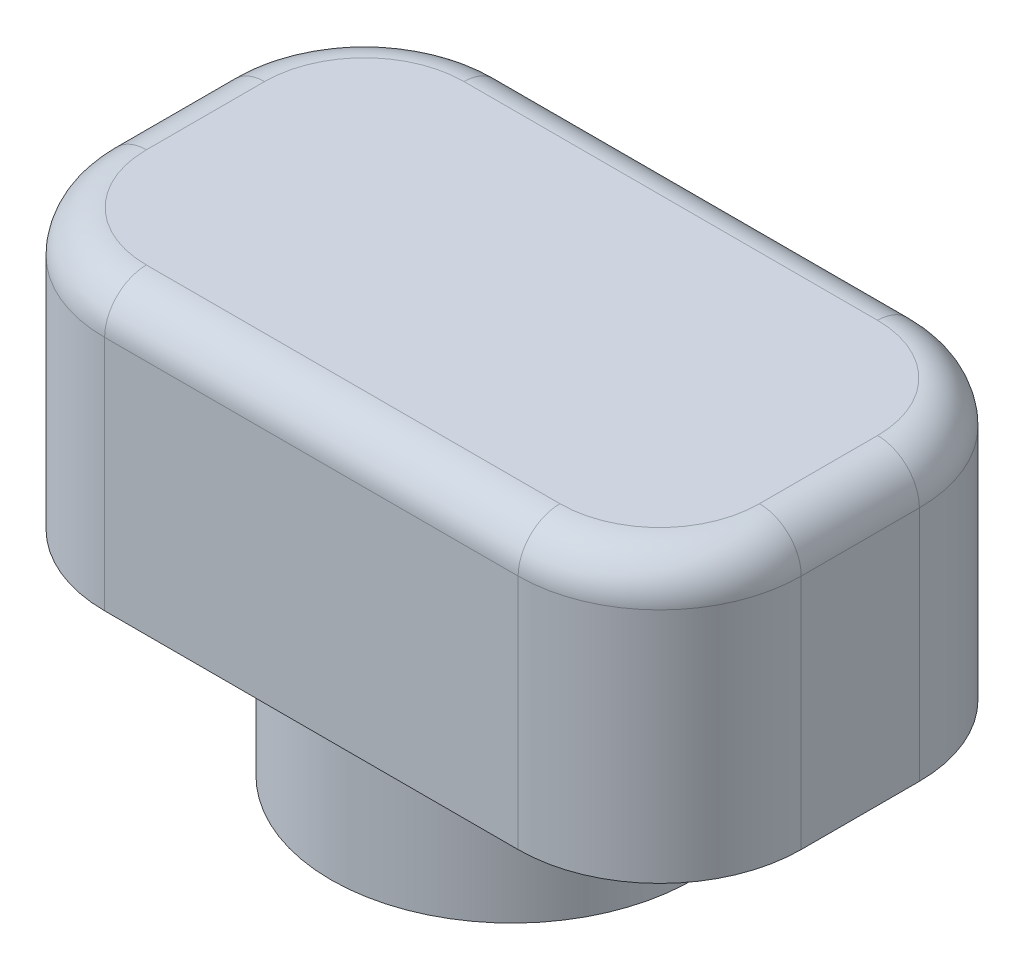
ISO-10303-21;
HEADER;
FILE_DESCRIPTION(('STEP AP214'),'2;1');
FILE_NAME('part.step','',(''),(''),'','','');
FILE_SCHEMA(('AUTOMOTIVE_DESIGN { 1 0 10303 214 1 1 1 1 }'));
ENDSEC;
DATA;
#1=APPLICATION_CONTEXT('core data for automotive mechanical design processes');
#2=APPLICATION_PROTOCOL_DEFINITION('international standard','automotive_design',2000,#1);
#3=PRODUCT_CONTEXT('',#1,'mechanical');
#4=PRODUCT('Part','Part','',(#3));
#5=PRODUCT_RELATED_PRODUCT_CATEGORY('part','',(#4));
#6=PRODUCT_DEFINITION_FORMATION('','',#4);
#7=PRODUCT_DEFINITION_CONTEXT('part definition',#1,'design');
#8=PRODUCT_DEFINITION('design','',#6,#7);
#9=PRODUCT_DEFINITION_SHAPE('','',#8);
#10=(LENGTH_UNIT() NAMED_UNIT(*) SI_UNIT(.MILLI.,.METRE.));
#11=(NAMED_UNIT(*) PLANE_ANGLE_UNIT() SI_UNIT($,.RADIAN.));
#12=(NAMED_UNIT(*) SI_UNIT($,.STERADIAN.) SOLID_ANGLE_UNIT());
#13=UNCERTAINTY_MEASURE_WITH_UNIT(LENGTH_MEASURE(1.E-05),#10,'distance_accuracy_value','');
#14=(GEOMETRIC_REPRESENTATION_CONTEXT(3) GLOBAL_UNCERTAINTY_ASSIGNED_CONTEXT((#13)) GLOBAL_UNIT_ASSIGNED_CONTEXT((#10,
#11,#12)) REPRESENTATION_CONTEXT('',''));
#15=CARTESIAN_POINT('',(0.,0.,0.));
#16=DIRECTION('',(0.,0.,1.));
#17=DIRECTION('',(1.,0.,0.));
#18=AXIS2_PLACEMENT_3D('',#15,#16,#17);
#19=CARTESIAN_POINT('',(0.,2.5,0.));
#20=DIRECTION('',(0.,-1.,0.));
#21=DIRECTION('',(0.,0.,-1.));
#22=AXIS2_PLACEMENT_3D('',#19,#20,#21);
#23=CYLINDRICAL_SURFACE('',#22,3.25);
#24=CARTESIAN_POINT('',(0.,2.5,0.));
#25=DIRECTION('',(0.,1.,0.));
#26=DIRECTION('',(0.,0.,1.));
#27=AXIS2_PLACEMENT_3D('',#24,#25,#26);
#28=CIRCLE('',#27,3.25);
#29=CARTESIAN_POINT('',(0.,2.5,3.25));
#30=VERTEX_POINT('',#29);
#31=EDGE_CURVE('E187',#30,#30,#28,.T.);
#32=ORIENTED_EDGE('',*,*,#31,.F.);
#33=EDGE_LOOP('',(#32));
#34=FACE_BOUND('',#33,.T.);
#35=CARTESIAN_POINT('',(0.,0.,0.));
#36=DIRECTION('',(0.,1.,0.));
#37=DIRECTION('',(0.,0.,1.));
#38=AXIS2_PLACEMENT_3D('',#35,#36,#37);
#39=CIRCLE('',#38,3.25);
#40=CARTESIAN_POINT('',(0.,0.,3.25));
#41=VERTEX_POINT('',#40);
#42=EDGE_CURVE('E183',#41,#41,#39,.T.);
#43=ORIENTED_EDGE('',*,*,#42,.T.);
#44=EDGE_LOOP('',(#43));
#45=FACE_BOUND('',#44,.T.);
#46=ADVANCED_FACE('F47',(#34,#45),#23,.T.);
#47=CARTESIAN_POINT('',(0.,0.,0.));
#48=DIRECTION('',(0.,1.,0.));
#49=DIRECTION('',(0.,0.,1.));
#50=AXIS2_PLACEMENT_3D('',#47,#48,#49);
#51=PLANE('',#50);
#52=CARTESIAN_POINT('',(0.,0.,0.));
#53=DIRECTION('',(0.,-1.,0.));
#54=DIRECTION('',(0.,0.,-1.));
#55=AXIS2_PLACEMENT_3D('',#52,#53,#54);
#56=CIRCLE('',#55,1.75);
#57=CARTESIAN_POINT('',(0.,0.,-1.75));
#58=VERTEX_POINT('',#57);
#59=EDGE_CURVE('E173',#58,#58,#56,.T.);
#60=ORIENTED_EDGE('',*,*,#59,.F.);
#61=EDGE_LOOP('',(#60));
#62=FACE_BOUND('',#61,.T.);
#63=ORIENTED_EDGE('',*,*,#42,.F.);
#64=EDGE_LOOP('',(#63));
#65=FACE_BOUND('',#64,.T.);
#66=ADVANCED_FACE('F354',(#62,#65),#51,.F.);
#67=CARTESIAN_POINT('',(0.,2.5,0.));
#68=DIRECTION('',(0.,-1.,0.));
#69=DIRECTION('',(0.,0.,-1.));
#70=AXIS2_PLACEMENT_3D('',#67,#68,#69);
#71=CYLINDRICAL_SURFACE('',#70,1.75);
#72=CARTESIAN_POINT('',(0.,2.5,0.));
#73=DIRECTION('',(0.,-1.,0.));
#74=DIRECTION('',(0.,0.,-1.));
#75=AXIS2_PLACEMENT_3D('',#72,#73,#74);
#76=CIRCLE('',#75,1.75);
#77=CARTESIAN_POINT('',(0.,2.5,-1.75));
#78=VERTEX_POINT('',#77);
#79=EDGE_CURVE('E179',#78,#78,#76,.T.);
#80=ORIENTED_EDGE('',*,*,#79,.F.);
#81=EDGE_LOOP('',(#80));
#82=FACE_BOUND('',#81,.T.);
#83=ORIENTED_EDGE('',*,*,#59,.T.);
#84=EDGE_LOOP('',(#83));
#85=FACE_BOUND('',#84,.T.);
#86=ADVANCED_FACE('F360',(#82,#85),#71,.F.);
#87=CARTESIAN_POINT('',(0.,2.5,0.));
#88=DIRECTION('',(0.,1.,0.));
#89=DIRECTION('',(0.,0.,1.));
#90=AXIS2_PLACEMENT_3D('',#87,#88,#89);
#91=PLANE('',#90);
#92=ORIENTED_EDGE('',*,*,#31,.T.);
#93=EDGE_LOOP('',(#92));
#94=FACE_BOUND('',#93,.T.);
#95=DIRECTION('',(0.,0.,1.));
#96=VECTOR('',#95,1.);
#97=CARTESIAN_POINT('',(-6.25,2.5,-3.6));
#98=LINE('',#97,#96);
#99=CARTESIAN_POINT('',(-6.25,2.5,-1.06));
#100=VERTEX_POINT('',#99);
#101=CARTESIAN_POINT('',(-6.25,2.5,1.06));
#102=VERTEX_POINT('',#101);
#103=EDGE_CURVE('E142',#100,#102,#98,.T.);
#104=ORIENTED_EDGE('',*,*,#103,.F.);
#105=CARTESIAN_POINT('',(-3.71,2.5,-1.06));
#106=DIRECTION('',(0.,1.,0.));
#107=DIRECTION('',(0.,0.,1.));
#108=AXIS2_PLACEMENT_3D('',#105,#106,#107);
#109=CIRCLE('',#108,2.54);
#110=CARTESIAN_POINT('',(-3.71,2.5,-3.6));
#111=VERTEX_POINT('',#110);
#112=EDGE_CURVE('E152',#100,#111,#109,.F.);
#113=ORIENTED_EDGE('',*,*,#112,.T.);
#114=DIRECTION('',(-1.,0.,0.));
#115=VECTOR('',#114,1.);
#116=CARTESIAN_POINT('',(-6.25,2.5,-3.6));
#117=LINE('',#116,#115);
#118=CARTESIAN_POINT('',(3.71,2.5,-3.6));
#119=VERTEX_POINT('',#118);
#120=EDGE_CURVE('E168',#119,#111,#117,.T.);
#121=ORIENTED_EDGE('',*,*,#120,.F.);
#122=CARTESIAN_POINT('',(3.71,2.5,-1.06));
#123=DIRECTION('',(0.,1.,0.));
#124=DIRECTION('',(0.,0.,1.));
#125=AXIS2_PLACEMENT_3D('',#122,#123,#124);
#126=CIRCLE('',#125,2.54);
#127=CARTESIAN_POINT('',(6.25,2.5,-1.06));
#128=VERTEX_POINT('',#127);
#129=EDGE_CURVE('E161',#119,#128,#126,.F.);
#130=ORIENTED_EDGE('',*,*,#129,.T.);
#131=DIRECTION('',(0.,0.,-1.));
#132=VECTOR('',#131,1.);
#133=CARTESIAN_POINT('',(6.25,2.5,-3.6));
#134=LINE('',#133,#132);
#135=CARTESIAN_POINT('',(6.25,2.5,1.06));
#136=VERTEX_POINT('',#135);
#137=EDGE_CURVE('E175',#136,#128,#134,.T.);
#138=ORIENTED_EDGE('',*,*,#137,.F.);
#139=CARTESIAN_POINT('',(3.71,2.5,1.06));
#140=DIRECTION('',(0.,1.,0.));
#141=DIRECTION('',(0.,0.,1.));
#142=AXIS2_PLACEMENT_3D('',#139,#140,#141);
#143=CIRCLE('',#142,2.54);
#144=CARTESIAN_POINT('',(3.71,2.5,3.6));
#145=VERTEX_POINT('',#144);
#146=EDGE_CURVE('E198',#136,#145,#143,.F.);
#147=ORIENTED_EDGE('',*,*,#146,.T.);
#148=DIRECTION('',(1.,0.,0.));
#149=VECTOR('',#148,1.);
#150=CARTESIAN_POINT('',(-6.25,2.5,3.6));
#151=LINE('',#150,#149);
#152=CARTESIAN_POINT('',(-3.71,2.5,3.6));
#153=VERTEX_POINT('',#152);
#154=EDGE_CURVE('E167',#153,#145,#151,.T.);
#155=ORIENTED_EDGE('',*,*,#154,.F.);
#156=CARTESIAN_POINT('',(-3.71,2.5,1.06));
#157=DIRECTION('',(0.,1.,0.));
#158=DIRECTION('',(0.,0.,1.));
#159=AXIS2_PLACEMENT_3D('',#156,#157,#158);
#160=CIRCLE('',#159,2.54);
#161=EDGE_CURVE('E148',#153,#102,#160,.F.);
#162=ORIENTED_EDGE('',*,*,#161,.T.);
#163=EDGE_LOOP('',(#104,#113,#121,#130,#138,#147,#155,#162));
#164=FACE_BOUND('',#163,.T.);
#165=ADVANCED_FACE('F163',(#94,#164),#91,.F.);
#166=CARTESIAN_POINT('',(0.,7.5,0.));
#167=DIRECTION('',(0.,1.,0.));
#168=DIRECTION('',(0.,0.,1.));
#169=AXIS2_PLACEMENT_3D('',#166,#167,#168);
#170=PLANE('',#169);
#171=CARTESIAN_POINT('',(3.71,7.5,1.06));
#172=DIRECTION('',(0.,1.,0.));
#173=DIRECTION('',(0.,0.,1.));
#174=AXIS2_PLACEMENT_3D('',#171,#172,#173);
#175=CIRCLE('',#174,1.79);
#176=CARTESIAN_POINT('',(3.71,7.5,2.85));
#177=VERTEX_POINT('',#176);
#178=CARTESIAN_POINT('',(5.5,7.5,1.06));
#179=VERTEX_POINT('',#178);
#180=EDGE_CURVE('E238',#177,#179,#175,.T.);
#181=ORIENTED_EDGE('',*,*,#180,.T.);
#182=DIRECTION('',(0.,0.,-1.));
#183=VECTOR('',#182,1.);
#184=CARTESIAN_POINT('',(5.5,7.5,-1.06));
#185=LINE('',#184,#183);
#186=CARTESIAN_POINT('',(5.5,7.5,-1.06));
#187=VERTEX_POINT('',#186);
#188=EDGE_CURVE('E241',#179,#187,#185,.T.);
#189=ORIENTED_EDGE('',*,*,#188,.T.);
#190=CARTESIAN_POINT('',(3.71,7.5,-1.06));
#191=DIRECTION('',(0.,1.,0.));
#192=DIRECTION('',(0.,0.,1.));
#193=AXIS2_PLACEMENT_3D('',#190,#191,#192);
#194=CIRCLE('',#193,1.79);
#195=CARTESIAN_POINT('',(3.71,7.5,-2.85));
#196=VERTEX_POINT('',#195);
#197=EDGE_CURVE('E235',#187,#196,#194,.T.);
#198=ORIENTED_EDGE('',*,*,#197,.T.);
#199=DIRECTION('',(-1.,0.,0.));
#200=VECTOR('',#199,1.);
#201=CARTESIAN_POINT('',(-3.71,7.5,-2.85));
#202=LINE('',#201,#200);
#203=CARTESIAN_POINT('',(-3.71,7.5,-2.85));
#204=VERTEX_POINT('',#203);
#205=EDGE_CURVE('E232',#196,#204,#202,.T.);
#206=ORIENTED_EDGE('',*,*,#205,.T.);
#207=CARTESIAN_POINT('',(-3.71,7.5,-1.06));
#208=DIRECTION('',(0.,1.,0.));
#209=DIRECTION('',(0.,0.,1.));
#210=AXIS2_PLACEMENT_3D('',#207,#208,#209);
#211=CIRCLE('',#210,1.79);
#212=CARTESIAN_POINT('',(-5.5,7.5,-1.06));
#213=VERTEX_POINT('',#212);
#214=EDGE_CURVE('E229',#204,#213,#211,.T.);
#215=ORIENTED_EDGE('',*,*,#214,.T.);
#216=DIRECTION('',(0.,0.,1.));
#217=VECTOR('',#216,1.);
#218=CARTESIAN_POINT('',(-5.5,7.5,1.06));
#219=LINE('',#218,#217);
#220=CARTESIAN_POINT('',(-5.5,7.5,1.06));
#221=VERTEX_POINT('',#220);
#222=EDGE_CURVE('E226',#213,#221,#219,.T.);
#223=ORIENTED_EDGE('',*,*,#222,.T.);
#224=CARTESIAN_POINT('',(-3.71,7.5,1.06));
#225=DIRECTION('',(0.,1.,0.));
#226=DIRECTION('',(0.,0.,1.));
#227=AXIS2_PLACEMENT_3D('',#224,#225,#226);
#228=CIRCLE('',#227,1.79);
#229=CARTESIAN_POINT('',(-3.71,7.5,2.85));
#230=VERTEX_POINT('',#229);
#231=EDGE_CURVE('E223',#221,#230,#228,.T.);
#232=ORIENTED_EDGE('',*,*,#231,.T.);
#233=DIRECTION('',(1.,0.,0.));
#234=VECTOR('',#233,1.);
#235=CARTESIAN_POINT('',(3.71,7.5,2.85));
#236=LINE('',#235,#234);
#237=EDGE_CURVE('E220',#230,#177,#236,.T.);
#238=ORIENTED_EDGE('',*,*,#237,.T.);
#239=EDGE_LOOP('',(#181,#189,#198,#206,#215,#223,#232,#238));
#240=FACE_BOUND('',#239,.T.);
#241=ADVANCED_FACE('F337',(#240),#170,.T.);
#242=CARTESIAN_POINT('',(-6.25,7.5,3.6));
#243=DIRECTION('',(0.,0.,-1.));
#244=DIRECTION('',(-1.,0.,0.));
#245=AXIS2_PLACEMENT_3D('',#242,#243,#244);
#246=PLANE('',#245);
#247=DIRECTION('',(0.,-1.,0.));
#248=VECTOR('',#247,1.);
#249=CARTESIAN_POINT('',(3.71,7.5,3.6));
#250=LINE('',#249,#248);
#251=CARTESIAN_POINT('',(3.71,6.75,3.6));
#252=VERTEX_POINT('',#251);
#253=EDGE_CURVE('E217',#145,#252,#250,.F.);
#254=ORIENTED_EDGE('',*,*,#253,.T.);
#255=DIRECTION('',(1.,0.,0.));
#256=VECTOR('',#255,1.);
#257=CARTESIAN_POINT('',(-3.71,6.75,3.6));
#258=LINE('',#257,#256);
#259=CARTESIAN_POINT('',(-3.71,6.75,3.6));
#260=VERTEX_POINT('',#259);
#261=EDGE_CURVE('E11',#252,#260,#258,.F.);
#262=ORIENTED_EDGE('',*,*,#261,.T.);
#263=DIRECTION('',(0.,-1.,0.));
#264=VECTOR('',#263,1.);
#265=CARTESIAN_POINT('',(-3.71,7.5,3.6));
#266=LINE('',#265,#264);
#267=EDGE_CURVE('E214',#260,#153,#266,.T.);
#268=ORIENTED_EDGE('',*,*,#267,.T.);
#269=ORIENTED_EDGE('',*,*,#154,.T.);
#270=EDGE_LOOP('',(#254,#262,#268,#269));
#271=FACE_BOUND('',#270,.T.);
#272=ADVANCED_FACE('F324',(#271),#246,.F.);
#273=CARTESIAN_POINT('',(-6.25,7.5,-3.6));
#274=DIRECTION('',(1.,0.,0.));
#275=DIRECTION('',(0.,0.,-1.));
#276=AXIS2_PLACEMENT_3D('',#273,#274,#275);
#277=PLANE('',#276);
#278=DIRECTION('',(0.,-1.,0.));
#279=VECTOR('',#278,1.);
#280=CARTESIAN_POINT('',(-6.25,7.5,1.06));
#281=LINE('',#280,#279);
#282=CARTESIAN_POINT('',(-6.25,6.75,1.06));
#283=VERTEX_POINT('',#282);
#284=EDGE_CURVE('E149',#102,#283,#281,.F.);
#285=ORIENTED_EDGE('',*,*,#284,.T.);
#286=DIRECTION('',(0.,0.,1.));
#287=VECTOR('',#286,1.);
#288=CARTESIAN_POINT('',(-6.25,6.75,-1.06));
#289=LINE('',#288,#287);
#290=CARTESIAN_POINT('',(-6.25,6.75,-1.06));
#291=VERTEX_POINT('',#290);
#292=EDGE_CURVE('E144',#283,#291,#289,.F.);
#293=ORIENTED_EDGE('',*,*,#292,.T.);
#294=DIRECTION('',(0.,-1.,0.));
#295=VECTOR('',#294,1.);
#296=CARTESIAN_POINT('',(-6.25,7.5,-1.06));
#297=LINE('',#296,#295);
#298=EDGE_CURVE('E138',#291,#100,#297,.T.);
#299=ORIENTED_EDGE('',*,*,#298,.T.);
#300=ORIENTED_EDGE('',*,*,#103,.T.);
#301=EDGE_LOOP('',(#285,#293,#299,#300));
#302=FACE_BOUND('',#301,.T.);
#303=ADVANCED_FACE('F140',(#302),#277,.F.);
#304=CARTESIAN_POINT('',(-6.25,7.5,-3.6));
#305=DIRECTION('',(0.,0.,1.));
#306=DIRECTION('',(1.,0.,0.));
#307=AXIS2_PLACEMENT_3D('',#304,#305,#306);
#308=PLANE('',#307);
#309=DIRECTION('',(0.,-1.,0.));
#310=VECTOR('',#309,1.);
#311=CARTESIAN_POINT('',(-3.71,7.5,-3.6));
#312=LINE('',#311,#310);
#313=CARTESIAN_POINT('',(-3.71,6.75,-3.6));
#314=VERTEX_POINT('',#313);
#315=EDGE_CURVE('E155',#111,#314,#312,.F.);
#316=ORIENTED_EDGE('',*,*,#315,.T.);
#317=DIRECTION('',(-1.,0.,0.));
#318=VECTOR('',#317,1.);
#319=CARTESIAN_POINT('',(3.71,6.75,-3.6));
#320=LINE('',#319,#318);
#321=CARTESIAN_POINT('',(3.71,6.75,-3.6));
#322=VERTEX_POINT('',#321);
#323=EDGE_CURVE('E255',#314,#322,#320,.F.);
#324=ORIENTED_EDGE('',*,*,#323,.T.);
#325=DIRECTION('',(0.,-1.,0.));
#326=VECTOR('',#325,1.);
#327=CARTESIAN_POINT('',(3.71,7.5,-3.6));
#328=LINE('',#327,#326);
#329=EDGE_CURVE('E160',#322,#119,#328,.T.);
#330=ORIENTED_EDGE('',*,*,#329,.T.);
#331=ORIENTED_EDGE('',*,*,#120,.T.);
#332=EDGE_LOOP('',(#316,#324,#330,#331));
#333=FACE_BOUND('',#332,.T.);
#334=ADVANCED_FACE('F332',(#333),#308,.F.);
#335=CARTESIAN_POINT('',(6.25,7.5,-3.6));
#336=DIRECTION('',(-1.,0.,0.));
#337=DIRECTION('',(0.,0.,1.));
#338=AXIS2_PLACEMENT_3D('',#335,#336,#337);
#339=PLANE('',#338);
#340=DIRECTION('',(0.,-1.,0.));
#341=VECTOR('',#340,1.);
#342=CARTESIAN_POINT('',(6.25,7.5,-1.06));
#343=LINE('',#342,#341);
#344=CARTESIAN_POINT('',(6.25,6.75,-1.06));
#345=VERTEX_POINT('',#344);
#346=EDGE_CURVE('E210',#128,#345,#343,.F.);
#347=ORIENTED_EDGE('',*,*,#346,.T.);
#348=DIRECTION('',(0.,0.,-1.));
#349=VECTOR('',#348,1.);
#350=CARTESIAN_POINT('',(6.25,6.75,1.06));
#351=LINE('',#350,#349);
#352=CARTESIAN_POINT('',(6.25,6.75,1.06));
#353=VERTEX_POINT('',#352);
#354=EDGE_CURVE('E245',#345,#353,#351,.F.);
#355=ORIENTED_EDGE('',*,*,#354,.T.);
#356=DIRECTION('',(0.,-1.,0.));
#357=VECTOR('',#356,1.);
#358=CARTESIAN_POINT('',(6.25,7.5,1.06));
#359=LINE('',#358,#357);
#360=EDGE_CURVE('E207',#353,#136,#359,.T.);
#361=ORIENTED_EDGE('',*,*,#360,.T.);
#362=ORIENTED_EDGE('',*,*,#137,.T.);
#363=EDGE_LOOP('',(#347,#355,#361,#362));
#364=FACE_BOUND('',#363,.T.);
#365=ADVANCED_FACE('F302',(#364),#339,.F.);
#366=ORIENTED_EDGE('',*,*,#79,.T.);
#367=EDGE_LOOP('',(#366));
#368=FACE_BOUND('',#367,.T.);
#369=ADVANCED_FACE('F369',(#368),#91,.F.);
#370=CARTESIAN_POINT('',(-3.71,7.5,-1.06));
#371=DIRECTION('',(0.,-1.,0.));
#372=DIRECTION('',(0.,0.,-1.));
#373=AXIS2_PLACEMENT_3D('',#370,#371,#372);
#374=CYLINDRICAL_SURFACE('',#373,2.54);
#375=ORIENTED_EDGE('',*,*,#298,.F.);
#376=CARTESIAN_POINT('',(-3.71,6.75,-1.06));
#377=DIRECTION('',(0.,1.,0.));
#378=DIRECTION('',(0.,0.,1.));
#379=AXIS2_PLACEMENT_3D('',#376,#377,#378);
#380=CIRCLE('',#379,2.54);
#381=EDGE_CURVE('E258',#291,#314,#380,.F.);
#382=ORIENTED_EDGE('',*,*,#381,.T.);
#383=ORIENTED_EDGE('',*,*,#315,.F.);
#384=ORIENTED_EDGE('',*,*,#112,.F.);
#385=EDGE_LOOP('',(#375,#382,#383,#384));
#386=FACE_BOUND('',#385,.T.);
#387=ADVANCED_FACE('F153',(#386),#374,.T.);
#388=CARTESIAN_POINT('',(3.71,7.5,-1.06));
#389=DIRECTION('',(0.,-1.,0.));
#390=DIRECTION('',(0.,0.,-1.));
#391=AXIS2_PLACEMENT_3D('',#388,#389,#390);
#392=CYLINDRICAL_SURFACE('',#391,2.54);
#393=ORIENTED_EDGE('',*,*,#329,.F.);
#394=CARTESIAN_POINT('',(3.71,6.75,-1.06));
#395=DIRECTION('',(0.,1.,0.));
#396=DIRECTION('',(0.,0.,1.));
#397=AXIS2_PLACEMENT_3D('',#394,#395,#396);
#398=CIRCLE('',#397,2.54);
#399=EDGE_CURVE('E252',#322,#345,#398,.F.);
#400=ORIENTED_EDGE('',*,*,#399,.T.);
#401=ORIENTED_EDGE('',*,*,#346,.F.);
#402=ORIENTED_EDGE('',*,*,#129,.F.);
#403=EDGE_LOOP('',(#393,#400,#401,#402));
#404=FACE_BOUND('',#403,.T.);
#405=ADVANCED_FACE('F309',(#404),#392,.T.);
#406=CARTESIAN_POINT('',(3.71,7.5,1.06));
#407=DIRECTION('',(0.,-1.,0.));
#408=DIRECTION('',(0.,0.,-1.));
#409=AXIS2_PLACEMENT_3D('',#406,#407,#408);
#410=CYLINDRICAL_SURFACE('',#409,2.54);
#411=ORIENTED_EDGE('',*,*,#360,.F.);
#412=CARTESIAN_POINT('',(3.71,6.75,1.06));
#413=DIRECTION('',(0.,1.,0.));
#414=DIRECTION('',(0.,0.,1.));
#415=AXIS2_PLACEMENT_3D('',#412,#413,#414);
#416=CIRCLE('',#415,2.54);
#417=EDGE_CURVE('E249',#353,#252,#416,.F.);
#418=ORIENTED_EDGE('',*,*,#417,.T.);
#419=ORIENTED_EDGE('',*,*,#253,.F.);
#420=ORIENTED_EDGE('',*,*,#146,.F.);
#421=EDGE_LOOP('',(#411,#418,#419,#420));
#422=FACE_BOUND('',#421,.T.);
#423=ADVANCED_FACE('F322',(#422),#410,.T.);
#424=CARTESIAN_POINT('',(-3.71,7.5,1.06));
#425=DIRECTION('',(0.,-1.,0.));
#426=DIRECTION('',(0.,0.,-1.));
#427=AXIS2_PLACEMENT_3D('',#424,#425,#426);
#428=CYLINDRICAL_SURFACE('',#427,2.54);
#429=ORIENTED_EDGE('',*,*,#267,.F.);
#430=CARTESIAN_POINT('',(-3.71,6.75,1.06));
#431=DIRECTION('',(0.,1.,0.));
#432=DIRECTION('',(0.,0.,1.));
#433=AXIS2_PLACEMENT_3D('',#430,#431,#432);
#434=CIRCLE('',#433,2.54);
#435=EDGE_CURVE('E57',#260,#283,#434,.F.);
#436=ORIENTED_EDGE('',*,*,#435,.T.);
#437=ORIENTED_EDGE('',*,*,#284,.F.);
#438=ORIENTED_EDGE('',*,*,#161,.F.);
#439=EDGE_LOOP('',(#429,#436,#437,#438));
#440=FACE_BOUND('',#439,.T.);
#441=ADVANCED_FACE('F325',(#440),#428,.T.);
#442=CARTESIAN_POINT('',(-5.5,6.75,0.));
#443=DIRECTION('',(0.,0.,-1.));
#444=DIRECTION('',(-1.,0.,0.));
#445=AXIS2_PLACEMENT_3D('',#442,#443,#444);
#446=CYLINDRICAL_SURFACE('',#445,0.75);
#447=CARTESIAN_POINT('',(-5.5,6.75,-1.06));
#448=DIRECTION('',(0.,0.,-1.));
#449=DIRECTION('',(-1.,0.,0.));
#450=AXIS2_PLACEMENT_3D('',#447,#448,#449);
#451=CIRCLE('',#450,0.75);
#452=EDGE_CURVE('E286',#291,#213,#451,.T.);
#453=ORIENTED_EDGE('',*,*,#452,.F.);
#454=ORIENTED_EDGE('',*,*,#292,.F.);
#455=CARTESIAN_POINT('',(-5.5,6.75,1.06));
#456=DIRECTION('',(0.,0.,1.));
#457=DIRECTION('',(1.,0.,0.));
#458=AXIS2_PLACEMENT_3D('',#455,#456,#457);
#459=CIRCLE('',#458,0.75);
#460=EDGE_CURVE('E51',#221,#283,#459,.T.);
#461=ORIENTED_EDGE('',*,*,#460,.F.);
#462=ORIENTED_EDGE('',*,*,#222,.F.);
#463=EDGE_LOOP('',(#453,#454,#461,#462));
#464=FACE_BOUND('',#463,.T.);
#465=ADVANCED_FACE('F49',(#464),#446,.T.);
#466=CARTESIAN_POINT('',(-3.71,6.75,1.06));
#467=DIRECTION('',(0.,1.,0.));
#468=DIRECTION('',(0.,0.,1.));
#469=AXIS2_PLACEMENT_3D('',#466,#467,#468);
#470=TOROIDAL_SURFACE('',#469,1.79,0.75);
#471=ORIENTED_EDGE('',*,*,#460,.T.);
#472=ORIENTED_EDGE('',*,*,#435,.F.);
#473=CARTESIAN_POINT('',(-3.71,6.75,2.85));
#474=DIRECTION('',(1.,0.,0.));
#475=DIRECTION('',(0.,0.,-1.));
#476=AXIS2_PLACEMENT_3D('',#473,#474,#475);
#477=CIRCLE('',#476,0.75);
#478=EDGE_CURVE('E283',#230,#260,#477,.T.);
#479=ORIENTED_EDGE('',*,*,#478,.F.);
#480=ORIENTED_EDGE('',*,*,#231,.F.);
#481=EDGE_LOOP('',(#471,#472,#479,#480));
#482=FACE_BOUND('',#481,.T.);
#483=ADVANCED_FACE('F346',(#482),#470,.T.);
#484=CARTESIAN_POINT('',(-3.71,6.75,-1.06));
#485=DIRECTION('',(0.,1.,0.));
#486=DIRECTION('',(0.,0.,1.));
#487=AXIS2_PLACEMENT_3D('',#484,#485,#486);
#488=TOROIDAL_SURFACE('',#487,1.79,0.75);
#489=ORIENTED_EDGE('',*,*,#452,.T.);
#490=ORIENTED_EDGE('',*,*,#214,.F.);
#491=CARTESIAN_POINT('',(-3.71,6.75,-2.85));
#492=DIRECTION('',(1.,0.,0.));
#493=DIRECTION('',(0.,0.,-1.));
#494=AXIS2_PLACEMENT_3D('',#491,#492,#493);
#495=CIRCLE('',#494,0.75);
#496=EDGE_CURVE('E279',#314,#204,#495,.T.);
#497=ORIENTED_EDGE('',*,*,#496,.F.);
#498=ORIENTED_EDGE('',*,*,#381,.F.);
#499=EDGE_LOOP('',(#489,#490,#497,#498));
#500=FACE_BOUND('',#499,.T.);
#501=ADVANCED_FACE('F329',(#500),#488,.T.);
#502=CARTESIAN_POINT('',(0.,6.75,2.85));
#503=DIRECTION('',(-1.,0.,0.));
#504=DIRECTION('',(0.,0.,1.));
#505=AXIS2_PLACEMENT_3D('',#502,#503,#504);
#506=CYLINDRICAL_SURFACE('',#505,0.75);
#507=ORIENTED_EDGE('',*,*,#478,.T.);
#508=ORIENTED_EDGE('',*,*,#261,.F.);
#509=CARTESIAN_POINT('',(3.71,6.75,2.85));
#510=DIRECTION('',(1.,0.,0.));
#511=DIRECTION('',(0.,0.,-1.));
#512=AXIS2_PLACEMENT_3D('',#509,#510,#511);
#513=CIRCLE('',#512,0.75);
#514=EDGE_CURVE('E275',#177,#252,#513,.T.);
#515=ORIENTED_EDGE('',*,*,#514,.F.);
#516=ORIENTED_EDGE('',*,*,#237,.F.);
#517=EDGE_LOOP('',(#507,#508,#515,#516));
#518=FACE_BOUND('',#517,.T.);
#519=ADVANCED_FACE('F344',(#518),#506,.T.);
#520=CARTESIAN_POINT('',(0.,6.75,-2.85));
#521=DIRECTION('',(1.,0.,0.));
#522=DIRECTION('',(0.,0.,-1.));
#523=AXIS2_PLACEMENT_3D('',#520,#521,#522);
#524=CYLINDRICAL_SURFACE('',#523,0.75);
#525=ORIENTED_EDGE('',*,*,#496,.T.);
#526=ORIENTED_EDGE('',*,*,#205,.F.);
#527=CARTESIAN_POINT('',(3.71,6.75,-2.85));
#528=DIRECTION('',(1.,0.,0.));
#529=DIRECTION('',(0.,0.,-1.));
#530=AXIS2_PLACEMENT_3D('',#527,#528,#529);
#531=CIRCLE('',#530,0.75);
#532=EDGE_CURVE('E271',#322,#196,#531,.T.);
#533=ORIENTED_EDGE('',*,*,#532,.F.);
#534=ORIENTED_EDGE('',*,*,#323,.F.);
#535=EDGE_LOOP('',(#525,#526,#533,#534));
#536=FACE_BOUND('',#535,.T.);
#537=ADVANCED_FACE('F334',(#536),#524,.T.);
#538=CARTESIAN_POINT('',(3.71,6.75,1.06));
#539=DIRECTION('',(0.,1.,0.));
#540=DIRECTION('',(0.,0.,1.));
#541=AXIS2_PLACEMENT_3D('',#538,#539,#540);
#542=TOROIDAL_SURFACE('',#541,1.79,0.75);
#543=ORIENTED_EDGE('',*,*,#514,.T.);
#544=ORIENTED_EDGE('',*,*,#417,.F.);
#545=CARTESIAN_POINT('',(5.5,6.75,1.06));
#546=DIRECTION('',(0.,0.,-1.));
#547=DIRECTION('',(-1.,0.,0.));
#548=AXIS2_PLACEMENT_3D('',#545,#546,#547);
#549=CIRCLE('',#548,0.75);
#550=EDGE_CURVE('E268',#179,#353,#549,.T.);
#551=ORIENTED_EDGE('',*,*,#550,.F.);
#552=ORIENTED_EDGE('',*,*,#180,.F.);
#553=EDGE_LOOP('',(#543,#544,#551,#552));
#554=FACE_BOUND('',#553,.T.);
#555=ADVANCED_FACE('F342',(#554),#542,.T.);
#556=CARTESIAN_POINT('',(3.71,6.75,-1.06));
#557=DIRECTION('',(0.,1.,0.));
#558=DIRECTION('',(0.,0.,1.));
#559=AXIS2_PLACEMENT_3D('',#556,#557,#558);
#560=TOROIDAL_SURFACE('',#559,1.79,0.75);
#561=ORIENTED_EDGE('',*,*,#532,.T.);
#562=ORIENTED_EDGE('',*,*,#197,.F.);
#563=CARTESIAN_POINT('',(5.5,6.75,-1.06));
#564=DIRECTION('',(0.,0.,1.));
#565=DIRECTION('',(1.,0.,0.));
#566=AXIS2_PLACEMENT_3D('',#563,#564,#565);
#567=CIRCLE('',#566,0.75);
#568=EDGE_CURVE('E265',#345,#187,#567,.T.);
#569=ORIENTED_EDGE('',*,*,#568,.F.);
#570=ORIENTED_EDGE('',*,*,#399,.F.);
#571=EDGE_LOOP('',(#561,#562,#569,#570));
#572=FACE_BOUND('',#571,.T.);
#573=ADVANCED_FACE('F314',(#572),#560,.T.);
#574=CARTESIAN_POINT('',(5.5,6.75,0.));
#575=DIRECTION('',(0.,0.,1.));
#576=DIRECTION('',(1.,0.,0.));
#577=AXIS2_PLACEMENT_3D('',#574,#575,#576);
#578=CYLINDRICAL_SURFACE('',#577,0.75);
#579=ORIENTED_EDGE('',*,*,#550,.T.);
#580=ORIENTED_EDGE('',*,*,#354,.F.);
#581=ORIENTED_EDGE('',*,*,#568,.T.);
#582=ORIENTED_EDGE('',*,*,#188,.F.);
#583=EDGE_LOOP('',(#579,#580,#581,#582));
#584=FACE_BOUND('',#583,.T.);
#585=ADVANCED_FACE('F318',(#584),#578,.T.);
#586=CLOSED_SHELL('',(#46,#66,#86,#165,#241,#272,#303,#334,#365,#369,#387,#405,#423,#441,#465,
#483,#501,#519,#537,#555,#573,#585));
#587=MANIFOLD_SOLID_BREP('B2',#586);
#588=ADVANCED_BREP_SHAPE_REPRESENTATION('',(#18,#587),#14);
#589=SHAPE_DEFINITION_REPRESENTATION(#9,#588);
ENDSEC;
END-ISO-10303-21;
